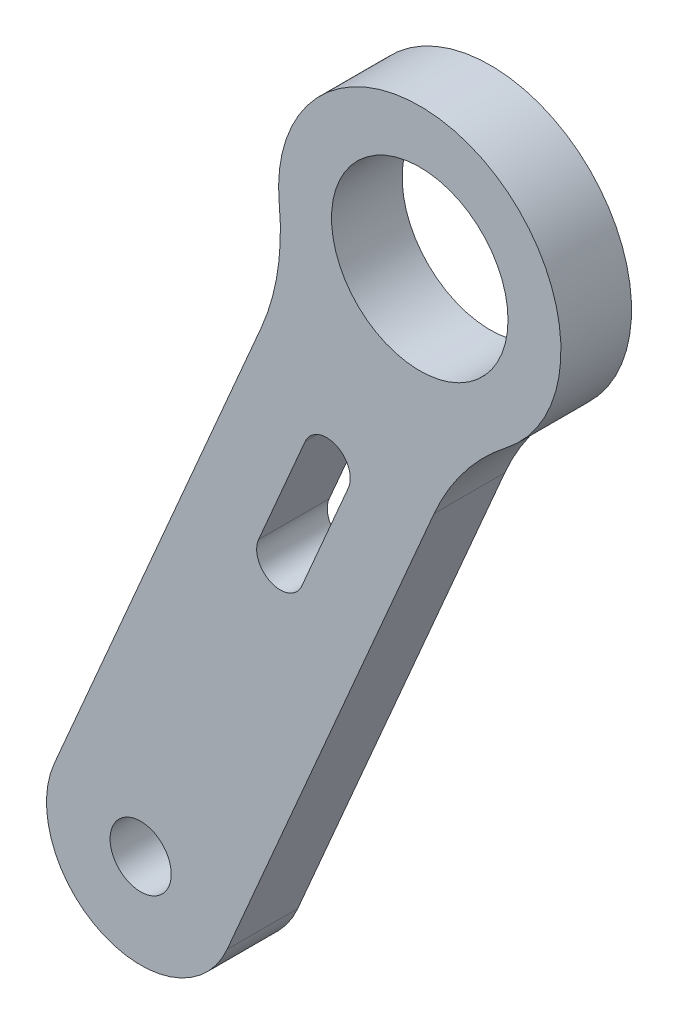
ISO-10303-21;
HEADER;
FILE_DESCRIPTION(('STEP AP214'),'2;1');
FILE_NAME('part.step','',(''),(''),'','','');
FILE_SCHEMA(('AUTOMOTIVE_DESIGN { 1 0 10303 214 1 1 1 1 }'));
ENDSEC;
DATA;
#1=APPLICATION_CONTEXT('core data for automotive mechanical design processes');
#2=APPLICATION_PROTOCOL_DEFINITION('international standard','automotive_design',2000,#1);
#3=PRODUCT_CONTEXT('',#1,'mechanical');
#4=PRODUCT('Part','Part','',(#3));
#5=PRODUCT_RELATED_PRODUCT_CATEGORY('part','',(#4));
#6=PRODUCT_DEFINITION_FORMATION('','',#4);
#7=PRODUCT_DEFINITION_CONTEXT('part definition',#1,'design');
#8=PRODUCT_DEFINITION('design','',#6,#7);
#9=PRODUCT_DEFINITION_SHAPE('','',#8);
#10=(LENGTH_UNIT() NAMED_UNIT(*) SI_UNIT(.MILLI.,.METRE.));
#11=(NAMED_UNIT(*) PLANE_ANGLE_UNIT() SI_UNIT($,.RADIAN.));
#12=(NAMED_UNIT(*) SI_UNIT($,.STERADIAN.) SOLID_ANGLE_UNIT());
#13=UNCERTAINTY_MEASURE_WITH_UNIT(LENGTH_MEASURE(1.E-05),#10,'distance_accuracy_value','');
#14=(GEOMETRIC_REPRESENTATION_CONTEXT(3) GLOBAL_UNCERTAINTY_ASSIGNED_CONTEXT((#13)) GLOBAL_UNIT_ASSIGNED_CONTEXT((#10,
#11,#12)) REPRESENTATION_CONTEXT('',''));
#15=CARTESIAN_POINT('',(0.,0.,0.));
#16=DIRECTION('',(0.,0.,1.));
#17=DIRECTION('',(1.,0.,0.));
#18=AXIS2_PLACEMENT_3D('',#15,#16,#17);
#19=CARTESIAN_POINT('',(54.5230976562454,24.4345589876044,3.));
#20=DIRECTION('',(0.,0.,1.));
#21=DIRECTION('',(1.,0.,0.));
#22=AXIS2_PLACEMENT_3D('',#19,#20,#21);
#23=PLANE('',#22);
#24=CARTESIAN_POINT('',(54.5230976562454,24.4345589876044,3.));
#25=DIRECTION('',(0.,0.,1.));
#26=DIRECTION('',(1.,0.,0.));
#27=AXIS2_PLACEMENT_3D('',#24,#25,#26);
#28=CIRCLE('',#27,1.29999999999996);
#29=CARTESIAN_POINT('',(55.8230976562453,24.4345589876044,3.));
#30=VERTEX_POINT('',#29);
#31=EDGE_CURVE('E151',#30,#30,#28,.T.);
#32=ORIENTED_EDGE('',*,*,#31,.F.);
#33=EDGE_LOOP('',(#32));
#34=FACE_BOUND('',#33,.T.);
#35=CARTESIAN_POINT('',(54.5230976562454,24.4345589876044,3.));
#36=DIRECTION('',(0.,0.,1.));
#37=DIRECTION('',(1.,0.,0.));
#38=AXIS2_PLACEMENT_3D('',#35,#36,#37);
#39=CIRCLE('',#38,3.99999999999989);
#40=CARTESIAN_POINT('',(50.8490360404422,26.0160997787479,3.));
#41=VERTEX_POINT('',#40);
#42=CARTESIAN_POINT('',(58.1971592649829,22.8530181995024,3.));
#43=VERTEX_POINT('',#42);
#44=EDGE_CURVE('E157',#41,#43,#39,.T.);
#45=ORIENTED_EDGE('',*,*,#44,.T.);
#46=DIRECTION('',(0.395385197405706,0.918515403067608,0.));
#47=VECTOR('',#46,1.);
#48=CARTESIAN_POINT('',(58.1971592649829,22.8530181995024,3.));
#49=LINE('',#48,#47);
#50=CARTESIAN_POINT('',(66.9960614480495,43.293659979369,3.));
#51=VERTEX_POINT('',#50);
#52=EDGE_CURVE('E160',#43,#51,#49,.T.);
#53=ORIENTED_EDGE('',*,*,#52,.T.);
#54=CARTESIAN_POINT('',(76.1810004591875,39.3399388522741,3.));
#55=DIRECTION('',(0.,0.,-1.));
#56=DIRECTION('',(1.,0.,0.));
#57=AXIS2_PLACEMENT_3D('',#54,#55,#56);
#58=CIRCLE('',#57,9.99975076635218);
#59=CARTESIAN_POINT('',(70.0583445195646,47.2461452519427,3.));
#60=VERTEX_POINT('',#59);
#61=EDGE_CURVE('E163',#51,#60,#58,.T.);
#62=ORIENTED_EDGE('',*,*,#61,.T.);
#63=CARTESIAN_POINT('',(66.3846347843131,51.9899774289665,3.));
#64=DIRECTION('',(0.,0.,1.));
#65=DIRECTION('',(1.,0.,0.));
#66=AXIS2_PLACEMENT_3D('',#63,#64,#65);
#67=CIRCLE('',#66,6.0000072452163);
#68=CARTESIAN_POINT('',(60.4139327873546,51.3976898247026,3.));
#69=VERTEX_POINT('',#68);
#70=EDGE_CURVE('E165',#60,#69,#67,.T.);
#71=ORIENTED_EDGE('',*,*,#70,.T.);
#72=CARTESIAN_POINT('',(50.4630270232986,50.4105272929945,3.));
#73=DIRECTION('',(0.,0.,-1.));
#74=DIRECTION('',(1.,0.,0.));
#75=AXIS2_PLACEMENT_3D('',#72,#73,#74);
#76=CIRCLE('',#75,9.99975076635073);
#77=CARTESIAN_POINT('',(59.6479382235088,46.4567415586146,3.));
#78=VERTEX_POINT('',#77);
#79=EDGE_CURVE('E167',#69,#78,#76,.T.);
#80=ORIENTED_EDGE('',*,*,#79,.T.);
#81=DIRECTION('',(-0.395385197405702,-0.91851540306761,0.));
#82=VECTOR('',#81,1.);
#83=CARTESIAN_POINT('',(59.6479382235088,46.4567415586146,3.));
#84=LINE('',#83,#82);
#85=EDGE_CURVE('E169',#78,#41,#84,.T.);
#86=ORIENTED_EDGE('',*,*,#85,.T.);
#87=EDGE_LOOP('',(#45,#53,#62,#71,#80,#86));
#88=FACE_BOUND('',#87,.T.);
#89=CARTESIAN_POINT('',(66.384679731394,51.9899553861234,3.));
#90=DIRECTION('',(0.,0.,1.));
#91=DIRECTION('',(1.,0.,0.));
#92=AXIS2_PLACEMENT_3D('',#89,#90,#91);
#93=CIRCLE('',#92,3.74995000033335);
#94=CARTESIAN_POINT('',(70.1346297317274,51.9899553861234,3.));
#95=VERTEX_POINT('',#94);
#96=EDGE_CURVE('E145',#95,#95,#93,.T.);
#97=ORIENTED_EDGE('',*,*,#96,.F.);
#98=EDGE_LOOP('',(#97));
#99=FACE_BOUND('',#98,.T.);
#100=DIRECTION('',(0.39538519740569,0.918515403067615,0.));
#101=VECTOR('',#100,1.);
#102=CARTESIAN_POINT('',(63.3493170038943,42.4094818530716,3.));
#103=LINE('',#102,#101);
#104=CARTESIAN_POINT('',(61.3723910168658,37.8169048377336,3.));
#105=VERTEX_POINT('',#104);
#106=CARTESIAN_POINT('',(63.3493170038943,42.4094818530716,3.));
#107=VERTEX_POINT('',#106);
#108=EDGE_CURVE('E117',#105,#107,#103,.T.);
#109=ORIENTED_EDGE('',*,*,#108,.F.);
#110=CARTESIAN_POINT('',(60.4538756137982,38.2122900351393,3.));
#111=DIRECTION('',(0.,0.,1.));
#112=DIRECTION('',(1.,0.,0.));
#113=AXIS2_PLACEMENT_3D('',#110,#111,#112);
#114=CIRCLE('',#113,1.00000000000003);
#115=CARTESIAN_POINT('',(59.5353602107306,38.607675232545,3.));
#116=VERTEX_POINT('',#115);
#117=EDGE_CURVE('E109',#116,#105,#114,.T.);
#118=ORIENTED_EDGE('',*,*,#117,.F.);
#119=DIRECTION('',(-0.395385197405697,-0.918515403067612,0.));
#120=VECTOR('',#119,1.);
#121=CARTESIAN_POINT('',(61.512286197759,43.200252247883,3.));
#122=LINE('',#121,#120);
#123=CARTESIAN_POINT('',(61.512286197759,43.200252247883,3.));
#124=VERTEX_POINT('',#123);
#125=EDGE_CURVE('E131',#124,#116,#122,.T.);
#126=ORIENTED_EDGE('',*,*,#125,.F.);
#127=CARTESIAN_POINT('',(62.4308016008266,42.8048670504773,3.));
#128=DIRECTION('',(0.,0.,1.));
#129=DIRECTION('',(1.,0.,0.));
#130=AXIS2_PLACEMENT_3D('',#127,#128,#129);
#131=CIRCLE('',#130,1.00000000000001);
#132=EDGE_CURVE('E129',#107,#124,#131,.T.);
#133=ORIENTED_EDGE('',*,*,#132,.F.);
#134=EDGE_LOOP('',(#109,#118,#126,#133));
#135=FACE_BOUND('',#134,.T.);
#136=ADVANCED_FACE('F32',(#34,#88,#99,#135),#23,.T.);
#137=CARTESIAN_POINT('',(54.5230976562454,24.4345589876044,0.));
#138=DIRECTION('',(0.,0.,1.));
#139=DIRECTION('',(1.,0.,0.));
#140=AXIS2_PLACEMENT_3D('',#137,#138,#139);
#141=PLANE('',#140);
#142=CARTESIAN_POINT('',(66.384679731394,51.9899553861234,0.));
#143=DIRECTION('',(0.,0.,1.));
#144=DIRECTION('',(1.,0.,0.));
#145=AXIS2_PLACEMENT_3D('',#142,#143,#144);
#146=CIRCLE('',#145,3.74995000033335);
#147=CARTESIAN_POINT('',(70.1346297317274,51.9899553861234,0.));
#148=VERTEX_POINT('',#147);
#149=EDGE_CURVE('E125',#148,#148,#146,.T.);
#150=ORIENTED_EDGE('',*,*,#149,.T.);
#151=EDGE_LOOP('',(#150));
#152=FACE_BOUND('',#151,.T.);
#153=CARTESIAN_POINT('',(54.5230976562454,24.4345589876044,0.));
#154=DIRECTION('',(0.,0.,1.));
#155=DIRECTION('',(1.,0.,0.));
#156=AXIS2_PLACEMENT_3D('',#153,#154,#155);
#157=CIRCLE('',#156,1.29999999999996);
#158=CARTESIAN_POINT('',(55.8230976562453,24.4345589876044,0.));
#159=VERTEX_POINT('',#158);
#160=EDGE_CURVE('E148',#159,#159,#157,.T.);
#161=ORIENTED_EDGE('',*,*,#160,.T.);
#162=EDGE_LOOP('',(#161));
#163=FACE_BOUND('',#162,.T.);
#164=CARTESIAN_POINT('',(54.5230976562454,24.4345589876044,0.));
#165=DIRECTION('',(0.,0.,1.));
#166=DIRECTION('',(1.,0.,0.));
#167=AXIS2_PLACEMENT_3D('',#164,#165,#166);
#168=CIRCLE('',#167,3.99999999999989);
#169=CARTESIAN_POINT('',(50.8490360404422,26.0160997787479,0.));
#170=VERTEX_POINT('',#169);
#171=CARTESIAN_POINT('',(58.1971592649829,22.8530181995024,0.));
#172=VERTEX_POINT('',#171);
#173=EDGE_CURVE('E154',#170,#172,#168,.T.);
#174=ORIENTED_EDGE('',*,*,#173,.F.);
#175=DIRECTION('',(-0.395385197405702,-0.91851540306761,0.));
#176=VECTOR('',#175,1.);
#177=CARTESIAN_POINT('',(59.6479382235088,46.4567415586146,0.));
#178=LINE('',#177,#176);
#179=CARTESIAN_POINT('',(59.6479382235088,46.4567415586146,0.));
#180=VERTEX_POINT('',#179);
#181=EDGE_CURVE('E161',#180,#170,#178,.T.);
#182=ORIENTED_EDGE('',*,*,#181,.F.);
#183=CARTESIAN_POINT('',(50.4630270232986,50.4105272929945,0.));
#184=DIRECTION('',(0.,0.,-1.));
#185=DIRECTION('',(1.,0.,0.));
#186=AXIS2_PLACEMENT_3D('',#183,#184,#185);
#187=CIRCLE('',#186,9.99975076635073);
#188=CARTESIAN_POINT('',(60.4139327873546,51.3976898247026,0.));
#189=VERTEX_POINT('',#188);
#190=EDGE_CURVE('E180',#189,#180,#187,.T.);
#191=ORIENTED_EDGE('',*,*,#190,.F.);
#192=CARTESIAN_POINT('',(66.3846347843131,51.9899774289665,0.));
#193=DIRECTION('',(0.,0.,1.));
#194=DIRECTION('',(1.,0.,0.));
#195=AXIS2_PLACEMENT_3D('',#192,#193,#194);
#196=CIRCLE('',#195,6.0000072452163);
#197=CARTESIAN_POINT('',(70.0583445195646,47.2461452519427,0.));
#198=VERTEX_POINT('',#197);
#199=EDGE_CURVE('E178',#198,#189,#196,.T.);
#200=ORIENTED_EDGE('',*,*,#199,.F.);
#201=CARTESIAN_POINT('',(76.1810004591875,39.3399388522741,0.));
#202=DIRECTION('',(0.,0.,-1.));
#203=DIRECTION('',(1.,0.,0.));
#204=AXIS2_PLACEMENT_3D('',#201,#202,#203);
#205=CIRCLE('',#204,9.99975076635218);
#206=CARTESIAN_POINT('',(66.9960614480495,43.293659979369,0.));
#207=VERTEX_POINT('',#206);
#208=EDGE_CURVE('E176',#207,#198,#205,.T.);
#209=ORIENTED_EDGE('',*,*,#208,.F.);
#210=DIRECTION('',(0.395385197405706,0.918515403067608,0.));
#211=VECTOR('',#210,1.);
#212=CARTESIAN_POINT('',(58.1971592649829,22.8530181995024,0.));
#213=LINE('',#212,#211);
#214=EDGE_CURVE('E174',#172,#207,#213,.T.);
#215=ORIENTED_EDGE('',*,*,#214,.F.);
#216=EDGE_LOOP('',(#174,#182,#191,#200,#209,#215));
#217=FACE_BOUND('',#216,.T.);
#218=CARTESIAN_POINT('',(60.4538756137982,38.2122900351393,0.));
#219=DIRECTION('',(0.,0.,1.));
#220=DIRECTION('',(1.,0.,0.));
#221=AXIS2_PLACEMENT_3D('',#218,#219,#220);
#222=CIRCLE('',#221,1.00000000000003);
#223=CARTESIAN_POINT('',(59.5353602107306,38.607675232545,0.));
#224=VERTEX_POINT('',#223);
#225=CARTESIAN_POINT('',(61.3723910168658,37.8169048377336,0.));
#226=VERTEX_POINT('',#225);
#227=EDGE_CURVE('E55',#224,#226,#222,.T.);
#228=ORIENTED_EDGE('',*,*,#227,.T.);
#229=DIRECTION('',(0.39538519740569,0.918515403067615,0.));
#230=VECTOR('',#229,1.);
#231=CARTESIAN_POINT('',(63.3493170038943,42.4094818530716,0.));
#232=LINE('',#231,#230);
#233=CARTESIAN_POINT('',(63.3493170038943,42.4094818530716,0.));
#234=VERTEX_POINT('',#233);
#235=EDGE_CURVE('E124',#226,#234,#232,.T.);
#236=ORIENTED_EDGE('',*,*,#235,.T.);
#237=CARTESIAN_POINT('',(62.4308016008266,42.8048670504773,0.));
#238=DIRECTION('',(0.,0.,1.));
#239=DIRECTION('',(1.,0.,0.));
#240=AXIS2_PLACEMENT_3D('',#237,#238,#239);
#241=CIRCLE('',#240,1.00000000000001);
#242=CARTESIAN_POINT('',(61.512286197759,43.200252247883,0.));
#243=VERTEX_POINT('',#242);
#244=EDGE_CURVE('E137',#234,#243,#241,.T.);
#245=ORIENTED_EDGE('',*,*,#244,.T.);
#246=DIRECTION('',(-0.395385197405697,-0.918515403067612,0.));
#247=VECTOR('',#246,1.);
#248=CARTESIAN_POINT('',(61.512286197759,43.200252247883,0.));
#249=LINE('',#248,#247);
#250=EDGE_CURVE('E118',#243,#224,#249,.T.);
#251=ORIENTED_EDGE('',*,*,#250,.T.);
#252=EDGE_LOOP('',(#228,#236,#245,#251));
#253=FACE_BOUND('',#252,.T.);
#254=ADVANCED_FACE('F204',(#152,#163,#217,#253),#141,.F.);
#255=CARTESIAN_POINT('',(54.5230976562454,24.4345589876044,3.));
#256=DIRECTION('',(0.,0.,-1.));
#257=DIRECTION('',(-1.,0.,0.));
#258=AXIS2_PLACEMENT_3D('',#255,#256,#257);
#259=CYLINDRICAL_SURFACE('',#258,3.99999999999989);
#260=ORIENTED_EDGE('',*,*,#173,.T.);
#261=DIRECTION('',(0.,0.,-1.));
#262=VECTOR('',#261,1.);
#263=CARTESIAN_POINT('',(58.1971592649829,22.8530181995024,3.));
#264=LINE('',#263,#262);
#265=EDGE_CURVE('E11',#43,#172,#264,.T.);
#266=ORIENTED_EDGE('',*,*,#265,.F.);
#267=ORIENTED_EDGE('',*,*,#44,.F.);
#268=DIRECTION('',(0.,0.,-1.));
#269=VECTOR('',#268,1.);
#270=CARTESIAN_POINT('',(50.8490360404422,26.0160997787479,3.));
#271=LINE('',#270,#269);
#272=EDGE_CURVE('E171',#41,#170,#271,.T.);
#273=ORIENTED_EDGE('',*,*,#272,.T.);
#274=EDGE_LOOP('',(#260,#266,#267,#273));
#275=FACE_BOUND('',#274,.T.);
#276=ADVANCED_FACE('F34',(#275),#259,.T.);
#277=CARTESIAN_POINT('',(58.1971592649829,22.8530181995024,3.));
#278=DIRECTION('',(-0.918515403067608,0.395385197405706,0.));
#279=DIRECTION('',(-0.395385197405706,-0.918515403067608,0.));
#280=AXIS2_PLACEMENT_3D('',#277,#278,#279);
#281=PLANE('',#280);
#282=ORIENTED_EDGE('',*,*,#214,.T.);
#283=DIRECTION('',(0.,0.,-1.));
#284=VECTOR('',#283,1.);
#285=CARTESIAN_POINT('',(66.9960614480495,43.293659979369,3.));
#286=LINE('',#285,#284);
#287=EDGE_CURVE('E40',#51,#207,#286,.T.);
#288=ORIENTED_EDGE('',*,*,#287,.F.);
#289=ORIENTED_EDGE('',*,*,#52,.F.);
#290=ORIENTED_EDGE('',*,*,#265,.T.);
#291=EDGE_LOOP('',(#282,#288,#289,#290));
#292=FACE_BOUND('',#291,.T.);
#293=ADVANCED_FACE('F222',(#292),#281,.F.);
#294=CARTESIAN_POINT('',(76.1810004591875,39.3399388522741,3.));
#295=DIRECTION('',(0.,0.,-1.));
#296=DIRECTION('',(-1.,0.,0.));
#297=AXIS2_PLACEMENT_3D('',#294,#295,#296);
#298=CYLINDRICAL_SURFACE('',#297,9.99975076635218);
#299=ORIENTED_EDGE('',*,*,#208,.T.);
#300=DIRECTION('',(0.,0.,-1.));
#301=VECTOR('',#300,1.);
#302=CARTESIAN_POINT('',(70.0583445195646,47.2461452519427,3.));
#303=LINE('',#302,#301);
#304=EDGE_CURVE('E191',#60,#198,#303,.T.);
#305=ORIENTED_EDGE('',*,*,#304,.F.);
#306=ORIENTED_EDGE('',*,*,#61,.F.);
#307=ORIENTED_EDGE('',*,*,#287,.T.);
#308=EDGE_LOOP('',(#299,#305,#306,#307));
#309=FACE_BOUND('',#308,.T.);
#310=ADVANCED_FACE('F198',(#309),#298,.F.);
#311=CARTESIAN_POINT('',(66.3846347843131,51.9899774289665,3.));
#312=DIRECTION('',(0.,0.,-1.));
#313=DIRECTION('',(-1.,0.,0.));
#314=AXIS2_PLACEMENT_3D('',#311,#312,#313);
#315=CYLINDRICAL_SURFACE('',#314,6.0000072452163);
#316=ORIENTED_EDGE('',*,*,#199,.T.);
#317=DIRECTION('',(0.,0.,-1.));
#318=VECTOR('',#317,1.);
#319=CARTESIAN_POINT('',(60.4139327873546,51.3976898247026,3.));
#320=LINE('',#319,#318);
#321=EDGE_CURVE('E188',#69,#189,#320,.T.);
#322=ORIENTED_EDGE('',*,*,#321,.F.);
#323=ORIENTED_EDGE('',*,*,#70,.F.);
#324=ORIENTED_EDGE('',*,*,#304,.T.);
#325=EDGE_LOOP('',(#316,#322,#323,#324));
#326=FACE_BOUND('',#325,.T.);
#327=ADVANCED_FACE('F210',(#326),#315,.T.);
#328=CARTESIAN_POINT('',(50.4630270232986,50.4105272929945,3.));
#329=DIRECTION('',(0.,0.,-1.));
#330=DIRECTION('',(-1.,0.,0.));
#331=AXIS2_PLACEMENT_3D('',#328,#329,#330);
#332=CYLINDRICAL_SURFACE('',#331,9.99975076635073);
#333=ORIENTED_EDGE('',*,*,#190,.T.);
#334=DIRECTION('',(0.,0.,-1.));
#335=VECTOR('',#334,1.);
#336=CARTESIAN_POINT('',(59.6479382235088,46.4567415586146,3.));
#337=LINE('',#336,#335);
#338=EDGE_CURVE('E185',#78,#180,#337,.T.);
#339=ORIENTED_EDGE('',*,*,#338,.F.);
#340=ORIENTED_EDGE('',*,*,#79,.F.);
#341=ORIENTED_EDGE('',*,*,#321,.T.);
#342=EDGE_LOOP('',(#333,#339,#340,#341));
#343=FACE_BOUND('',#342,.T.);
#344=ADVANCED_FACE('F214',(#343),#332,.F.);
#345=CARTESIAN_POINT('',(59.6479382235088,46.4567415586146,3.));
#346=DIRECTION('',(0.91851540306761,-0.395385197405702,0.));
#347=DIRECTION('',(0.395385197405702,0.91851540306761,0.));
#348=AXIS2_PLACEMENT_3D('',#345,#346,#347);
#349=PLANE('',#348);
#350=ORIENTED_EDGE('',*,*,#181,.T.);
#351=ORIENTED_EDGE('',*,*,#272,.F.);
#352=ORIENTED_EDGE('',*,*,#85,.F.);
#353=ORIENTED_EDGE('',*,*,#338,.T.);
#354=EDGE_LOOP('',(#350,#351,#352,#353));
#355=FACE_BOUND('',#354,.T.);
#356=ADVANCED_FACE('F225',(#355),#349,.F.);
#357=CARTESIAN_POINT('',(54.5230976562454,24.4345589876044,3.));
#358=DIRECTION('',(0.,0.,-1.));
#359=DIRECTION('',(-1.,0.,0.));
#360=AXIS2_PLACEMENT_3D('',#357,#358,#359);
#361=CYLINDRICAL_SURFACE('',#360,1.29999999999996);
#362=ORIENTED_EDGE('',*,*,#31,.T.);
#363=EDGE_LOOP('',(#362));
#364=FACE_BOUND('',#363,.T.);
#365=ORIENTED_EDGE('',*,*,#160,.F.);
#366=EDGE_LOOP('',(#365));
#367=FACE_BOUND('',#366,.T.);
#368=ADVANCED_FACE('F227',(#364,#367),#361,.F.);
#369=CARTESIAN_POINT('',(66.384679731394,51.9899553861234,3.));
#370=DIRECTION('',(0.,0.,-1.));
#371=DIRECTION('',(-1.,0.,0.));
#372=AXIS2_PLACEMENT_3D('',#369,#370,#371);
#373=CYLINDRICAL_SURFACE('',#372,3.74995000033335);
#374=ORIENTED_EDGE('',*,*,#96,.T.);
#375=EDGE_LOOP('',(#374));
#376=FACE_BOUND('',#375,.T.);
#377=ORIENTED_EDGE('',*,*,#149,.F.);
#378=EDGE_LOOP('',(#377));
#379=FACE_BOUND('',#378,.T.);
#380=ADVANCED_FACE('F233',(#376,#379),#373,.F.);
#381=CARTESIAN_POINT('',(60.4538756137982,38.2122900351393,3.));
#382=DIRECTION('',(0.,0.,-1.));
#383=DIRECTION('',(-1.,0.,0.));
#384=AXIS2_PLACEMENT_3D('',#381,#382,#383);
#385=CYLINDRICAL_SURFACE('',#384,1.00000000000003);
#386=ORIENTED_EDGE('',*,*,#227,.F.);
#387=DIRECTION('',(0.,0.,-1.));
#388=VECTOR('',#387,1.);
#389=CARTESIAN_POINT('',(59.5353602107306,38.607675232545,3.));
#390=LINE('',#389,#388);
#391=EDGE_CURVE('E113',#116,#224,#390,.T.);
#392=ORIENTED_EDGE('',*,*,#391,.F.);
#393=ORIENTED_EDGE('',*,*,#117,.T.);
#394=DIRECTION('',(0.,0.,-1.));
#395=VECTOR('',#394,1.);
#396=CARTESIAN_POINT('',(61.3723910168658,37.8169048377336,3.));
#397=LINE('',#396,#395);
#398=EDGE_CURVE('E112',#105,#226,#397,.T.);
#399=ORIENTED_EDGE('',*,*,#398,.T.);
#400=EDGE_LOOP('',(#386,#392,#393,#399));
#401=FACE_BOUND('',#400,.T.);
#402=ADVANCED_FACE('F111',(#401),#385,.F.);
#403=CARTESIAN_POINT('',(63.3493170038943,42.4094818530716,3.));
#404=DIRECTION('',(-0.918515403067615,0.39538519740569,0.));
#405=DIRECTION('',(-0.39538519740569,-0.918515403067615,0.));
#406=AXIS2_PLACEMENT_3D('',#403,#404,#405);
#407=PLANE('',#406);
#408=ORIENTED_EDGE('',*,*,#235,.F.);
#409=ORIENTED_EDGE('',*,*,#398,.F.);
#410=ORIENTED_EDGE('',*,*,#108,.T.);
#411=DIRECTION('',(0.,0.,-1.));
#412=VECTOR('',#411,1.);
#413=CARTESIAN_POINT('',(63.3493170038943,42.4094818530716,3.));
#414=LINE('',#413,#412);
#415=EDGE_CURVE('E126',#107,#234,#414,.T.);
#416=ORIENTED_EDGE('',*,*,#415,.T.);
#417=EDGE_LOOP('',(#408,#409,#410,#416));
#418=FACE_BOUND('',#417,.T.);
#419=ADVANCED_FACE('F121',(#418),#407,.T.);
#420=CARTESIAN_POINT('',(62.4308016008266,42.8048670504773,3.));
#421=DIRECTION('',(0.,0.,-1.));
#422=DIRECTION('',(-1.,0.,0.));
#423=AXIS2_PLACEMENT_3D('',#420,#421,#422);
#424=CYLINDRICAL_SURFACE('',#423,1.00000000000001);
#425=ORIENTED_EDGE('',*,*,#244,.F.);
#426=ORIENTED_EDGE('',*,*,#415,.F.);
#427=ORIENTED_EDGE('',*,*,#132,.T.);
#428=DIRECTION('',(0.,0.,-1.));
#429=VECTOR('',#428,1.);
#430=CARTESIAN_POINT('',(61.512286197759,43.200252247883,3.));
#431=LINE('',#430,#429);
#432=EDGE_CURVE('E47',#124,#243,#431,.T.);
#433=ORIENTED_EDGE('',*,*,#432,.T.);
#434=EDGE_LOOP('',(#425,#426,#427,#433));
#435=FACE_BOUND('',#434,.T.);
#436=ADVANCED_FACE('F254',(#435),#424,.F.);
#437=CARTESIAN_POINT('',(61.512286197759,43.200252247883,3.));
#438=DIRECTION('',(0.918515403067612,-0.395385197405697,0.));
#439=DIRECTION('',(0.395385197405697,0.918515403067612,0.));
#440=AXIS2_PLACEMENT_3D('',#437,#438,#439);
#441=PLANE('',#440);
#442=ORIENTED_EDGE('',*,*,#250,.F.);
#443=ORIENTED_EDGE('',*,*,#432,.F.);
#444=ORIENTED_EDGE('',*,*,#125,.T.);
#445=ORIENTED_EDGE('',*,*,#391,.T.);
#446=EDGE_LOOP('',(#442,#443,#444,#445));
#447=FACE_BOUND('',#446,.T.);
#448=ADVANCED_FACE('F257',(#447),#441,.T.);
#449=CLOSED_SHELL('',(#136,#254,#276,#293,#310,#327,#344,#356,#368,#380,#402,#419,#436,#448));
#450=MANIFOLD_SOLID_BREP('B2',#449);
#451=ADVANCED_BREP_SHAPE_REPRESENTATION('',(#18,#450),#14);
#452=SHAPE_DEFINITION_REPRESENTATION(#9,#451);
ENDSEC;
END-ISO-10303-21;
